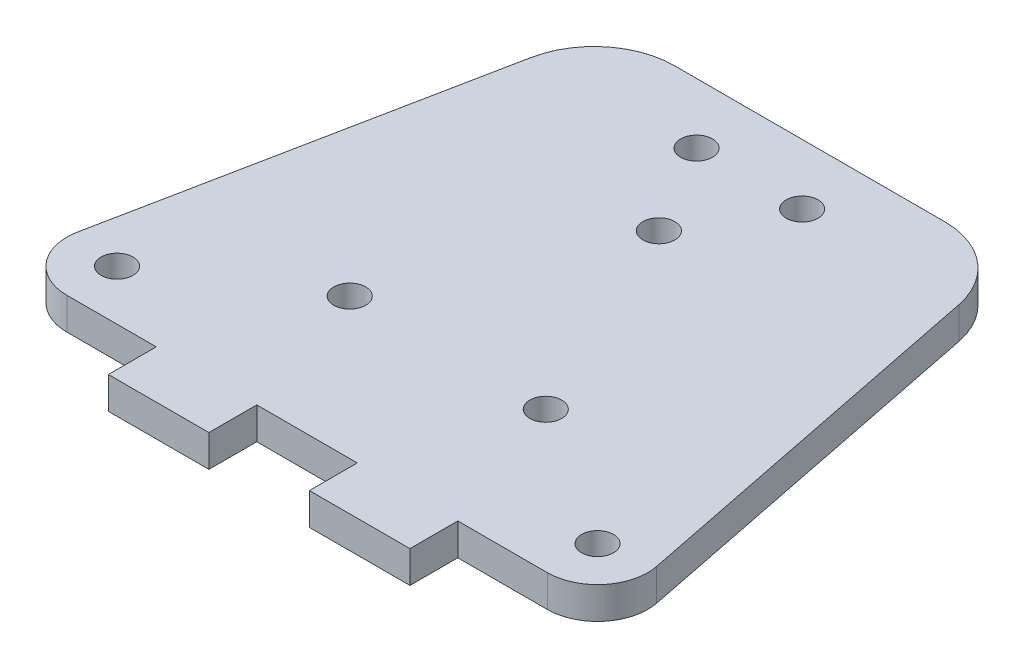
ISO-10303-21;
HEADER;
FILE_DESCRIPTION(('STEP AP214'),'2;1');
FILE_NAME('part.step','',(''),(''),'','','');
FILE_SCHEMA(('AUTOMOTIVE_DESIGN { 1 0 10303 214 1 1 1 1 }'));
ENDSEC;
DATA;
#1=APPLICATION_CONTEXT('core data for automotive mechanical design processes');
#2=APPLICATION_PROTOCOL_DEFINITION('international standard','automotive_design',2000,#1);
#3=PRODUCT_CONTEXT('',#1,'mechanical');
#4=PRODUCT('Part','Part','',(#3));
#5=PRODUCT_RELATED_PRODUCT_CATEGORY('part','',(#4));
#6=PRODUCT_DEFINITION_FORMATION('','',#4);
#7=PRODUCT_DEFINITION_CONTEXT('part definition',#1,'design');
#8=PRODUCT_DEFINITION('design','',#6,#7);
#9=PRODUCT_DEFINITION_SHAPE('','',#8);
#10=(LENGTH_UNIT() NAMED_UNIT(*) SI_UNIT(.MILLI.,.METRE.));
#11=(NAMED_UNIT(*) PLANE_ANGLE_UNIT() SI_UNIT($,.RADIAN.));
#12=(NAMED_UNIT(*) SI_UNIT($,.STERADIAN.) SOLID_ANGLE_UNIT());
#13=UNCERTAINTY_MEASURE_WITH_UNIT(LENGTH_MEASURE(1.E-05),#10,'distance_accuracy_value','');
#14=(GEOMETRIC_REPRESENTATION_CONTEXT(3) GLOBAL_UNCERTAINTY_ASSIGNED_CONTEXT((#13)) GLOBAL_UNIT_ASSIGNED_CONTEXT((#10,
#11,#12)) REPRESENTATION_CONTEXT('',''));
#15=CARTESIAN_POINT('',(0.,0.,0.));
#16=DIRECTION('',(0.,0.,1.));
#17=DIRECTION('',(1.,0.,0.));
#18=AXIS2_PLACEMENT_3D('',#15,#16,#17);
#19=CARTESIAN_POINT('',(0.,3.175,0.));
#20=DIRECTION('',(0.,0.,-1.));
#21=DIRECTION('',(-1.,0.,0.));
#22=AXIS2_PLACEMENT_3D('',#19,#20,#21);
#23=PLANE('',#22);
#24=DIRECTION('',(1.,0.,0.));
#25=VECTOR('',#24,1.);
#26=CARTESIAN_POINT('',(0.,0.,0.));
#27=LINE('',#26,#25);
#28=CARTESIAN_POINT('',(25.,0.,0.));
#29=VERTEX_POINT('',#28);
#30=CARTESIAN_POINT('',(35.,0.,0.));
#31=VERTEX_POINT('',#30);
#32=EDGE_CURVE('E306',#29,#31,#27,.T.);
#33=ORIENTED_EDGE('',*,*,#32,.T.);
#34=DIRECTION('',(0.,1.,0.));
#35=VECTOR('',#34,1.);
#36=CARTESIAN_POINT('',(35.,0.,0.));
#37=LINE('',#36,#35);
#38=CARTESIAN_POINT('',(35.,3.175,0.));
#39=VERTEX_POINT('',#38);
#40=EDGE_CURVE('E59',#31,#39,#37,.T.);
#41=ORIENTED_EDGE('',*,*,#40,.T.);
#42=DIRECTION('',(1.,0.,0.));
#43=VECTOR('',#42,1.);
#44=CARTESIAN_POINT('',(0.,3.175,0.));
#45=LINE('',#44,#43);
#46=CARTESIAN_POINT('',(25.,3.175,0.));
#47=VERTEX_POINT('',#46);
#48=EDGE_CURVE('E291',#47,#39,#45,.T.);
#49=ORIENTED_EDGE('',*,*,#48,.F.);
#50=DIRECTION('',(0.,1.,0.));
#51=VECTOR('',#50,1.);
#52=CARTESIAN_POINT('',(25.,0.,0.));
#53=LINE('',#52,#51);
#54=EDGE_CURVE('E208',#29,#47,#53,.T.);
#55=ORIENTED_EDGE('',*,*,#54,.F.);
#56=EDGE_LOOP('',(#33,#41,#49,#55));
#57=FACE_BOUND('',#56,.T.);
#58=ADVANCED_FACE('F36',(#57),#23,.F.);
#59=CARTESIAN_POINT('',(6.09901951359281,0.,0.));
#60=VERTEX_POINT('',#59);
#61=CARTESIAN_POINT('',(15.,0.,0.));
#62=VERTEX_POINT('',#61);
#63=EDGE_CURVE('E304',#60,#62,#27,.T.);
#64=ORIENTED_EDGE('',*,*,#63,.T.);
#65=DIRECTION('',(0.,1.,0.));
#66=VECTOR('',#65,1.);
#67=CARTESIAN_POINT('',(15.,0.,0.));
#68=LINE('',#67,#66);
#69=CARTESIAN_POINT('',(15.,3.175,0.));
#70=VERTEX_POINT('',#69);
#71=EDGE_CURVE('E205',#62,#70,#68,.T.);
#72=ORIENTED_EDGE('',*,*,#71,.T.);
#73=CARTESIAN_POINT('',(6.09901951359281,3.175,0.));
#74=VERTEX_POINT('',#73);
#75=EDGE_CURVE('E287',#74,#70,#45,.T.);
#76=ORIENTED_EDGE('',*,*,#75,.F.);
#77=DIRECTION('',(0.,1.,0.));
#78=VECTOR('',#77,1.);
#79=CARTESIAN_POINT('',(6.09901951359281,0.,0.));
#80=LINE('',#79,#78);
#81=EDGE_CURVE('E229',#60,#74,#80,.T.);
#82=ORIENTED_EDGE('',*,*,#81,.F.);
#83=EDGE_LOOP('',(#64,#72,#76,#82));
#84=FACE_BOUND('',#83,.T.);
#85=ADVANCED_FACE('F361',(#84),#23,.F.);
#86=CARTESIAN_POINT('',(45.,3.175,0.));
#87=VERTEX_POINT('',#86);
#88=CARTESIAN_POINT('',(53.9009804864072,3.175,0.));
#89=VERTEX_POINT('',#88);
#90=EDGE_CURVE('E51',#87,#89,#45,.T.);
#91=ORIENTED_EDGE('',*,*,#90,.F.);
#92=DIRECTION('',(0.,1.,0.));
#93=VECTOR('',#92,1.);
#94=CARTESIAN_POINT('',(45.,0.,0.));
#95=LINE('',#94,#93);
#96=CARTESIAN_POINT('',(45.,0.,0.));
#97=VERTEX_POINT('',#96);
#98=EDGE_CURVE('E184',#97,#87,#95,.T.);
#99=ORIENTED_EDGE('',*,*,#98,.F.);
#100=CARTESIAN_POINT('',(53.9009804864072,0.,0.));
#101=VERTEX_POINT('',#100);
#102=EDGE_CURVE('E303',#97,#101,#27,.T.);
#103=ORIENTED_EDGE('',*,*,#102,.T.);
#104=DIRECTION('',(0.,1.,0.));
#105=VECTOR('',#104,1.);
#106=CARTESIAN_POINT('',(53.9009804864072,0.,0.));
#107=LINE('',#106,#105);
#108=EDGE_CURVE('E217',#101,#89,#107,.T.);
#109=ORIENTED_EDGE('',*,*,#108,.T.);
#110=EDGE_LOOP('',(#91,#99,#103,#109));
#111=FACE_BOUND('',#110,.T.);
#112=ADVANCED_FACE('F377',(#111),#23,.F.);
#113=CARTESIAN_POINT('',(8.71378581622126,3.175,-43.5689290811055));
#114=DIRECTION('',(0.980580675690919,0.,0.196116135138188));
#115=DIRECTION('',(0.196116135138188,0.,-0.98058067569092));
#116=AXIS2_PLACEMENT_3D('',#113,#114,#115);
#117=PLANE('',#116);
#118=DIRECTION('',(0.,1.,0.));
#119=VECTOR('',#118,1.);
#120=CARTESIAN_POINT('',(1.19611613513821,0.,-5.98058067569094));
#121=LINE('',#120,#119);
#122=CARTESIAN_POINT('',(1.19611613513821,0.,-5.98058067569094));
#123=VERTEX_POINT('',#122);
#124=CARTESIAN_POINT('',(1.19611613513821,3.175,-5.98058067569094));
#125=VERTEX_POINT('',#124);
#126=EDGE_CURVE('E227',#123,#125,#121,.T.);
#127=ORIENTED_EDGE('',*,*,#126,.T.);
#128=DIRECTION('',(-0.196116135138188,0.,0.980580675690919));
#129=VECTOR('',#128,1.);
#130=CARTESIAN_POINT('',(8.71378581622126,3.175,-43.5689290811055));
#131=LINE('',#130,#129);
#132=CARTESIAN_POINT('',(8.71378581622126,3.175,-43.5689290811055));
#133=VERTEX_POINT('',#132);
#134=EDGE_CURVE('E284',#133,#125,#131,.T.);
#135=ORIENTED_EDGE('',*,*,#134,.F.);
#136=DIRECTION('',(0.,-1.,0.));
#137=VECTOR('',#136,1.);
#138=CARTESIAN_POINT('',(8.71378581622126,3.175,-43.5689290811055));
#139=LINE('',#138,#137);
#140=CARTESIAN_POINT('',(8.71378581622126,0.,-43.5689290811055));
#141=VERTEX_POINT('',#140);
#142=EDGE_CURVE('E310',#133,#141,#139,.T.);
#143=ORIENTED_EDGE('',*,*,#142,.T.);
#144=DIRECTION('',(-0.196116135138188,0.,0.980580675690919));
#145=VECTOR('',#144,1.);
#146=CARTESIAN_POINT('',(8.71378581622126,0.,-43.5689290811055));
#147=LINE('',#146,#145);
#148=EDGE_CURVE('E300',#141,#123,#147,.T.);
#149=ORIENTED_EDGE('',*,*,#148,.T.);
#150=EDGE_LOOP('',(#127,#135,#143,#149));
#151=FACE_BOUND('',#150,.T.);
#152=ADVANCED_FACE('F324',(#151),#117,.F.);
#153=CARTESIAN_POINT('',(43.4415687782517,3.175,-42.));
#154=DIRECTION('',(0.,1.,0.));
#155=DIRECTION('',(0.,0.,1.));
#156=AXIS2_PLACEMENT_3D('',#153,#154,#155);
#157=PLANE('',#156);
#158=CARTESIAN_POINT('',(53.9009804864072,3.175,-5.));
#159=DIRECTION('',(0.,-1.,0.));
#160=DIRECTION('',(0.,0.,1.));
#161=AXIS2_PLACEMENT_3D('',#158,#159,#160);
#162=CIRCLE('',#161,5.);
#163=CARTESIAN_POINT('',(58.8038838648618,3.175,-5.9805806756909));
#164=VERTEX_POINT('',#163);
#165=EDGE_CURVE('E207',#164,#89,#162,.T.);
#166=ORIENTED_EDGE('',*,*,#165,.F.);
#167=DIRECTION('',(-0.19611613513818,0.,-0.980580675690921));
#168=VECTOR('',#167,1.);
#169=CARTESIAN_POINT('',(51.2862141837791,3.175,-43.5689290811054));
#170=LINE('',#169,#168);
#171=CARTESIAN_POINT('',(51.2862141837791,3.175,-43.5689290811054));
#172=VERTEX_POINT('',#171);
#173=EDGE_CURVE('E290',#164,#172,#170,.T.);
#174=ORIENTED_EDGE('',*,*,#173,.T.);
#175=CARTESIAN_POINT('',(43.4415687782517,3.175,-42.));
#176=DIRECTION('',(0.,1.,0.));
#177=DIRECTION('',(0.,0.,1.));
#178=AXIS2_PLACEMENT_3D('',#175,#176,#177);
#179=CIRCLE('',#178,8.);
#180=CARTESIAN_POINT('',(43.4415687782517,3.175,-50.));
#181=VERTEX_POINT('',#180);
#182=EDGE_CURVE('E276',#172,#181,#179,.T.);
#183=ORIENTED_EDGE('',*,*,#182,.T.);
#184=DIRECTION('',(-1.,0.,0.));
#185=VECTOR('',#184,1.);
#186=CARTESIAN_POINT('',(16.5584312217487,3.175,-50.));
#187=LINE('',#186,#185);
#188=CARTESIAN_POINT('',(16.5584312217487,3.175,-50.));
#189=VERTEX_POINT('',#188);
#190=EDGE_CURVE('E279',#181,#189,#187,.T.);
#191=ORIENTED_EDGE('',*,*,#190,.T.);
#192=CARTESIAN_POINT('',(16.5584312217486,3.175,-42.));
#193=DIRECTION('',(0.,1.,0.));
#194=DIRECTION('',(0.,0.,-1.));
#195=AXIS2_PLACEMENT_3D('',#192,#193,#194);
#196=CIRCLE('',#195,8.);
#197=EDGE_CURVE('E282',#189,#133,#196,.T.);
#198=ORIENTED_EDGE('',*,*,#197,.T.);
#199=ORIENTED_EDGE('',*,*,#134,.T.);
#200=CARTESIAN_POINT('',(6.09901951359281,3.175,-5.));
#201=DIRECTION('',(0.,-1.,0.));
#202=DIRECTION('',(0.,0.,1.));
#203=AXIS2_PLACEMENT_3D('',#200,#201,#202);
#204=CIRCLE('',#203,5.);
#205=EDGE_CURVE('E222',#74,#125,#204,.T.);
#206=ORIENTED_EDGE('',*,*,#205,.F.);
#207=ORIENTED_EDGE('',*,*,#75,.T.);
#208=DIRECTION('',(0.,0.,1.));
#209=VECTOR('',#208,1.);
#210=CARTESIAN_POINT('',(15.,3.175,0.));
#211=LINE('',#210,#209);
#212=CARTESIAN_POINT('',(15.,3.175,4.7625));
#213=VERTEX_POINT('',#212);
#214=EDGE_CURVE('E183',#70,#213,#211,.T.);
#215=ORIENTED_EDGE('',*,*,#214,.T.);
#216=DIRECTION('',(1.,0.,0.));
#217=VECTOR('',#216,1.);
#218=CARTESIAN_POINT('',(15.,3.175,4.7625));
#219=LINE('',#218,#217);
#220=CARTESIAN_POINT('',(25.,3.175,4.7625));
#221=VERTEX_POINT('',#220);
#222=EDGE_CURVE('E200',#213,#221,#219,.T.);
#223=ORIENTED_EDGE('',*,*,#222,.T.);
#224=DIRECTION('',(0.,0.,-1.));
#225=VECTOR('',#224,1.);
#226=CARTESIAN_POINT('',(25.,3.175,0.));
#227=LINE('',#226,#225);
#228=EDGE_CURVE('E191',#221,#47,#227,.T.);
#229=ORIENTED_EDGE('',*,*,#228,.T.);
#230=ORIENTED_EDGE('',*,*,#48,.T.);
#231=DIRECTION('',(0.,0.,1.));
#232=VECTOR('',#231,1.);
#233=CARTESIAN_POINT('',(35.,3.175,0.));
#234=LINE('',#233,#232);
#235=CARTESIAN_POINT('',(35.,3.175,4.7625));
#236=VERTEX_POINT('',#235);
#237=EDGE_CURVE('E179',#39,#236,#234,.T.);
#238=ORIENTED_EDGE('',*,*,#237,.T.);
#239=DIRECTION('',(1.,0.,0.));
#240=VECTOR('',#239,1.);
#241=CARTESIAN_POINT('',(35.,3.175,4.7625));
#242=LINE('',#241,#240);
#243=CARTESIAN_POINT('',(45.,3.175,4.7625));
#244=VERTEX_POINT('',#243);
#245=EDGE_CURVE('E155',#236,#244,#242,.T.);
#246=ORIENTED_EDGE('',*,*,#245,.T.);
#247=DIRECTION('',(0.,0.,-1.));
#248=VECTOR('',#247,1.);
#249=CARTESIAN_POINT('',(45.,3.175,0.));
#250=LINE('',#249,#248);
#251=EDGE_CURVE('E173',#244,#87,#250,.T.);
#252=ORIENTED_EDGE('',*,*,#251,.T.);
#253=ORIENTED_EDGE('',*,*,#90,.T.);
#254=EDGE_LOOP('',(#166,#174,#183,#191,#198,#199,#206,#207,#215,#223,#229,#230,#238,#246,#252,#253));
#255=FACE_BOUND('',#254,.T.);
#256=CARTESIAN_POINT('',(53.9009804864072,3.175,-5.));
#257=DIRECTION('',(0.,1.,0.));
#258=DIRECTION('',(0.,0.,1.));
#259=AXIS2_PLACEMENT_3D('',#256,#257,#258);
#260=CIRCLE('',#259,1.5875);
#261=CARTESIAN_POINT('',(53.9009804864072,3.175,-3.4125));
#262=VERTEX_POINT('',#261);
#263=EDGE_CURVE('E231',#262,#262,#260,.T.);
#264=ORIENTED_EDGE('',*,*,#263,.F.);
#265=EDGE_LOOP('',(#264));
#266=FACE_BOUND('',#265,.T.);
#267=CARTESIAN_POINT('',(6.09901951359281,3.175,-5.));
#268=DIRECTION('',(0.,1.,0.));
#269=DIRECTION('',(0.,0.,1.));
#270=AXIS2_PLACEMENT_3D('',#267,#268,#269);
#271=CIRCLE('',#270,1.5875);
#272=CARTESIAN_POINT('',(6.09901951359281,3.175,-3.4125));
#273=VERTEX_POINT('',#272);
#274=EDGE_CURVE('E237',#273,#273,#271,.T.);
#275=ORIENTED_EDGE('',*,*,#274,.F.);
#276=EDGE_LOOP('',(#275));
#277=FACE_BOUND('',#276,.T.);
#278=CARTESIAN_POINT('',(30.,3.175,-35.));
#279=DIRECTION('',(0.,1.,0.));
#280=DIRECTION('',(0.,0.,1.));
#281=AXIS2_PLACEMENT_3D('',#278,#279,#280);
#282=CIRCLE('',#281,1.5875);
#283=CARTESIAN_POINT('',(30.,3.175,-33.4125));
#284=VERTEX_POINT('',#283);
#285=EDGE_CURVE('E243',#284,#284,#282,.T.);
#286=ORIENTED_EDGE('',*,*,#285,.F.);
#287=EDGE_LOOP('',(#286));
#288=FACE_BOUND('',#287,.T.);
#289=CARTESIAN_POINT('',(24.75,3.175,-44.));
#290=DIRECTION('',(0.,1.,0.));
#291=DIRECTION('',(0.,0.,1.));
#292=AXIS2_PLACEMENT_3D('',#289,#290,#291);
#293=CIRCLE('',#292,1.5875);
#294=CARTESIAN_POINT('',(24.75,3.175,-42.4125));
#295=VERTEX_POINT('',#294);
#296=EDGE_CURVE('E258',#295,#295,#293,.T.);
#297=ORIENTED_EDGE('',*,*,#296,.F.);
#298=EDGE_LOOP('',(#297));
#299=FACE_BOUND('',#298,.T.);
#300=CARTESIAN_POINT('',(39.75,3.175,-14.));
#301=DIRECTION('',(0.,1.,0.));
#302=DIRECTION('',(0.,0.,1.));
#303=AXIS2_PLACEMENT_3D('',#300,#301,#302);
#304=CIRCLE('',#303,1.5875);
#305=CARTESIAN_POINT('',(39.75,3.175,-12.4125));
#306=VERTEX_POINT('',#305);
#307=EDGE_CURVE('E270',#306,#306,#304,.T.);
#308=ORIENTED_EDGE('',*,*,#307,.F.);
#309=EDGE_LOOP('',(#308));
#310=FACE_BOUND('',#309,.T.);
#311=CARTESIAN_POINT('',(20.25,3.175,-14.));
#312=DIRECTION('',(0.,1.,0.));
#313=DIRECTION('',(0.,0.,1.));
#314=AXIS2_PLACEMENT_3D('',#311,#312,#313);
#315=CIRCLE('',#314,1.5875);
#316=CARTESIAN_POINT('',(20.25,3.175,-12.4125));
#317=VERTEX_POINT('',#316);
#318=EDGE_CURVE('E264',#317,#317,#315,.T.);
#319=ORIENTED_EDGE('',*,*,#318,.F.);
#320=EDGE_LOOP('',(#319));
#321=FACE_BOUND('',#320,.T.);
#322=CARTESIAN_POINT('',(35.25,3.175,-44.));
#323=DIRECTION('',(0.,1.,0.));
#324=DIRECTION('',(0.,0.,1.));
#325=AXIS2_PLACEMENT_3D('',#322,#323,#324);
#326=CIRCLE('',#325,1.5875);
#327=CARTESIAN_POINT('',(35.25,3.175,-42.4125));
#328=VERTEX_POINT('',#327);
#329=EDGE_CURVE('E252',#328,#328,#326,.T.);
#330=ORIENTED_EDGE('',*,*,#329,.F.);
#331=EDGE_LOOP('',(#330));
#332=FACE_BOUND('',#331,.T.);
#333=ADVANCED_FACE('F329',(#255,#266,#277,#288,#299,#310,#321,#332),#157,.T.);
#334=CARTESIAN_POINT('',(43.4415687782517,0.,-42.));
#335=DIRECTION('',(0.,1.,0.));
#336=DIRECTION('',(0.,0.,1.));
#337=AXIS2_PLACEMENT_3D('',#334,#335,#336);
#338=PLANE('',#337);
#339=CARTESIAN_POINT('',(53.9009804864072,0.,-5.));
#340=DIRECTION('',(0.,1.,0.));
#341=DIRECTION('',(0.,0.,1.));
#342=AXIS2_PLACEMENT_3D('',#339,#340,#341);
#343=CIRCLE('',#342,1.5875);
#344=CARTESIAN_POINT('',(53.9009804864072,0.,-3.4125));
#345=VERTEX_POINT('',#344);
#346=EDGE_CURVE('E234',#345,#345,#343,.T.);
#347=ORIENTED_EDGE('',*,*,#346,.T.);
#348=EDGE_LOOP('',(#347));
#349=FACE_BOUND('',#348,.T.);
#350=CARTESIAN_POINT('',(6.09901951359281,0.,-5.));
#351=DIRECTION('',(0.,1.,0.));
#352=DIRECTION('',(0.,0.,1.));
#353=AXIS2_PLACEMENT_3D('',#350,#351,#352);
#354=CIRCLE('',#353,1.5875);
#355=CARTESIAN_POINT('',(6.09901951359281,0.,-3.4125));
#356=VERTEX_POINT('',#355);
#357=EDGE_CURVE('E240',#356,#356,#354,.T.);
#358=ORIENTED_EDGE('',*,*,#357,.T.);
#359=EDGE_LOOP('',(#358));
#360=FACE_BOUND('',#359,.T.);
#361=CARTESIAN_POINT('',(30.,0.,-35.));
#362=DIRECTION('',(0.,1.,0.));
#363=DIRECTION('',(0.,0.,1.));
#364=AXIS2_PLACEMENT_3D('',#361,#362,#363);
#365=CIRCLE('',#364,1.5875);
#366=CARTESIAN_POINT('',(30.,0.,-33.4125));
#367=VERTEX_POINT('',#366);
#368=EDGE_CURVE('E246',#367,#367,#365,.T.);
#369=ORIENTED_EDGE('',*,*,#368,.T.);
#370=EDGE_LOOP('',(#369));
#371=FACE_BOUND('',#370,.T.);
#372=CARTESIAN_POINT('',(24.75,0.,-44.));
#373=DIRECTION('',(0.,1.,0.));
#374=DIRECTION('',(0.,0.,1.));
#375=AXIS2_PLACEMENT_3D('',#372,#373,#374);
#376=CIRCLE('',#375,1.5875);
#377=CARTESIAN_POINT('',(24.75,0.,-42.4125));
#378=VERTEX_POINT('',#377);
#379=EDGE_CURVE('E255',#378,#378,#376,.T.);
#380=ORIENTED_EDGE('',*,*,#379,.T.);
#381=EDGE_LOOP('',(#380));
#382=FACE_BOUND('',#381,.T.);
#383=CARTESIAN_POINT('',(39.75,0.,-14.));
#384=DIRECTION('',(0.,1.,0.));
#385=DIRECTION('',(0.,0.,1.));
#386=AXIS2_PLACEMENT_3D('',#383,#384,#385);
#387=CIRCLE('',#386,1.5875);
#388=CARTESIAN_POINT('',(39.75,0.,-12.4125));
#389=VERTEX_POINT('',#388);
#390=EDGE_CURVE('E267',#389,#389,#387,.T.);
#391=ORIENTED_EDGE('',*,*,#390,.T.);
#392=EDGE_LOOP('',(#391));
#393=FACE_BOUND('',#392,.T.);
#394=DIRECTION('',(-0.19611613513818,0.,-0.980580675690921));
#395=VECTOR('',#394,1.);
#396=CARTESIAN_POINT('',(51.2862141837791,0.,-43.5689290811054));
#397=LINE('',#396,#395);
#398=CARTESIAN_POINT('',(58.8038838648618,0.,-5.98058067569091));
#399=VERTEX_POINT('',#398);
#400=CARTESIAN_POINT('',(51.2862141837791,0.,-43.5689290811054));
#401=VERTEX_POINT('',#400);
#402=EDGE_CURVE('E280',#399,#401,#397,.T.);
#403=ORIENTED_EDGE('',*,*,#402,.F.);
#404=CARTESIAN_POINT('',(53.9009804864072,0.,-5.));
#405=DIRECTION('',(0.,-1.,0.));
#406=DIRECTION('',(0.,0.,1.));
#407=AXIS2_PLACEMENT_3D('',#404,#405,#406);
#408=CIRCLE('',#407,5.);
#409=EDGE_CURVE('E214',#399,#101,#408,.T.);
#410=ORIENTED_EDGE('',*,*,#409,.T.);
#411=ORIENTED_EDGE('',*,*,#102,.F.);
#412=DIRECTION('',(0.,0.,-1.));
#413=VECTOR('',#412,1.);
#414=CARTESIAN_POINT('',(45.,0.,0.));
#415=LINE('',#414,#413);
#416=CARTESIAN_POINT('',(45.,0.,4.7625));
#417=VERTEX_POINT('',#416);
#418=EDGE_CURVE('E161',#417,#97,#415,.T.);
#419=ORIENTED_EDGE('',*,*,#418,.F.);
#420=DIRECTION('',(1.,0.,0.));
#421=VECTOR('',#420,1.);
#422=CARTESIAN_POINT('',(35.,0.,4.7625));
#423=LINE('',#422,#421);
#424=CARTESIAN_POINT('',(35.,0.,4.7625));
#425=VERTEX_POINT('',#424);
#426=EDGE_CURVE('E153',#425,#417,#423,.T.);
#427=ORIENTED_EDGE('',*,*,#426,.F.);
#428=DIRECTION('',(0.,0.,1.));
#429=VECTOR('',#428,1.);
#430=CARTESIAN_POINT('',(35.,0.,0.));
#431=LINE('',#430,#429);
#432=EDGE_CURVE('E169',#31,#425,#431,.T.);
#433=ORIENTED_EDGE('',*,*,#432,.F.);
#434=ORIENTED_EDGE('',*,*,#32,.F.);
#435=DIRECTION('',(0.,0.,-1.));
#436=VECTOR('',#435,1.);
#437=CARTESIAN_POINT('',(25.,0.,0.));
#438=LINE('',#437,#436);
#439=CARTESIAN_POINT('',(25.,0.,4.7625));
#440=VERTEX_POINT('',#439);
#441=EDGE_CURVE('E194',#440,#29,#438,.T.);
#442=ORIENTED_EDGE('',*,*,#441,.F.);
#443=DIRECTION('',(1.,0.,0.));
#444=VECTOR('',#443,1.);
#445=CARTESIAN_POINT('',(15.,0.,4.7625));
#446=LINE('',#445,#444);
#447=CARTESIAN_POINT('',(15.,0.,4.7625));
#448=VERTEX_POINT('',#447);
#449=EDGE_CURVE('E190',#448,#440,#446,.T.);
#450=ORIENTED_EDGE('',*,*,#449,.F.);
#451=DIRECTION('',(0.,0.,1.));
#452=VECTOR('',#451,1.);
#453=CARTESIAN_POINT('',(15.,0.,0.));
#454=LINE('',#453,#452);
#455=EDGE_CURVE('E187',#62,#448,#454,.T.);
#456=ORIENTED_EDGE('',*,*,#455,.F.);
#457=ORIENTED_EDGE('',*,*,#63,.F.);
#458=CARTESIAN_POINT('',(6.09901951359281,0.,-5.));
#459=DIRECTION('',(0.,-1.,0.));
#460=DIRECTION('',(0.,0.,1.));
#461=AXIS2_PLACEMENT_3D('',#458,#459,#460);
#462=CIRCLE('',#461,5.);
#463=EDGE_CURVE('E224',#60,#123,#462,.T.);
#464=ORIENTED_EDGE('',*,*,#463,.T.);
#465=ORIENTED_EDGE('',*,*,#148,.F.);
#466=CARTESIAN_POINT('',(16.5584312217486,0.,-42.));
#467=DIRECTION('',(0.,1.,0.));
#468=DIRECTION('',(0.,0.,-1.));
#469=AXIS2_PLACEMENT_3D('',#466,#467,#468);
#470=CIRCLE('',#469,8.);
#471=CARTESIAN_POINT('',(16.5584312217487,0.,-50.));
#472=VERTEX_POINT('',#471);
#473=EDGE_CURVE('E298',#472,#141,#470,.T.);
#474=ORIENTED_EDGE('',*,*,#473,.F.);
#475=DIRECTION('',(-1.,0.,0.));
#476=VECTOR('',#475,1.);
#477=CARTESIAN_POINT('',(16.5584312217487,0.,-50.));
#478=LINE('',#477,#476);
#479=CARTESIAN_POINT('',(43.4415687782517,0.,-50.));
#480=VERTEX_POINT('',#479);
#481=EDGE_CURVE('E296',#480,#472,#478,.T.);
#482=ORIENTED_EDGE('',*,*,#481,.F.);
#483=CARTESIAN_POINT('',(43.4415687782517,0.,-42.));
#484=DIRECTION('',(0.,1.,0.));
#485=DIRECTION('',(0.,0.,1.));
#486=AXIS2_PLACEMENT_3D('',#483,#484,#485);
#487=CIRCLE('',#486,8.);
#488=EDGE_CURVE('E273',#401,#480,#487,.T.);
#489=ORIENTED_EDGE('',*,*,#488,.F.);
#490=EDGE_LOOP('',(#403,#410,#411,#419,#427,#433,#434,#442,#450,#456,#457,#464,#465,#474,#482,#489));
#491=FACE_BOUND('',#490,.T.);
#492=CARTESIAN_POINT('',(20.25,0.,-14.));
#493=DIRECTION('',(0.,1.,0.));
#494=DIRECTION('',(0.,0.,1.));
#495=AXIS2_PLACEMENT_3D('',#492,#493,#494);
#496=CIRCLE('',#495,1.5875);
#497=CARTESIAN_POINT('',(20.25,0.,-12.4125));
#498=VERTEX_POINT('',#497);
#499=EDGE_CURVE('E261',#498,#498,#496,.T.);
#500=ORIENTED_EDGE('',*,*,#499,.T.);
#501=EDGE_LOOP('',(#500));
#502=FACE_BOUND('',#501,.T.);
#503=CARTESIAN_POINT('',(35.25,0.,-44.));
#504=DIRECTION('',(0.,1.,0.));
#505=DIRECTION('',(0.,0.,1.));
#506=AXIS2_PLACEMENT_3D('',#503,#504,#505);
#507=CIRCLE('',#506,1.5875);
#508=CARTESIAN_POINT('',(35.25,0.,-42.4125));
#509=VERTEX_POINT('',#508);
#510=EDGE_CURVE('E249',#509,#509,#507,.T.);
#511=ORIENTED_EDGE('',*,*,#510,.T.);
#512=EDGE_LOOP('',(#511));
#513=FACE_BOUND('',#512,.T.);
#514=ADVANCED_FACE('F167',(#349,#360,#371,#382,#393,#491,#502,#513),#338,.F.);
#515=CARTESIAN_POINT('',(43.4415687782517,3.175,-42.));
#516=DIRECTION('',(0.,-1.,0.));
#517=DIRECTION('',(0.,0.,-1.));
#518=AXIS2_PLACEMENT_3D('',#515,#516,#517);
#519=CYLINDRICAL_SURFACE('',#518,8.);
#520=ORIENTED_EDGE('',*,*,#488,.T.);
#521=DIRECTION('',(0.,-1.,0.));
#522=VECTOR('',#521,1.);
#523=CARTESIAN_POINT('',(43.4415687782517,3.175,-50.));
#524=LINE('',#523,#522);
#525=EDGE_CURVE('E11',#181,#480,#524,.T.);
#526=ORIENTED_EDGE('',*,*,#525,.F.);
#527=ORIENTED_EDGE('',*,*,#182,.F.);
#528=DIRECTION('',(0.,-1.,0.));
#529=VECTOR('',#528,1.);
#530=CARTESIAN_POINT('',(51.2862141837791,3.175,-43.5689290811054));
#531=LINE('',#530,#529);
#532=EDGE_CURVE('E293',#172,#401,#531,.T.);
#533=ORIENTED_EDGE('',*,*,#532,.T.);
#534=EDGE_LOOP('',(#520,#526,#527,#533));
#535=FACE_BOUND('',#534,.T.);
#536=ADVANCED_FACE('F38',(#535),#519,.T.);
#537=CARTESIAN_POINT('',(16.5584312217487,3.175,-50.));
#538=DIRECTION('',(0.,0.,1.));
#539=DIRECTION('',(1.,0.,0.));
#540=AXIS2_PLACEMENT_3D('',#537,#538,#539);
#541=PLANE('',#540);
#542=ORIENTED_EDGE('',*,*,#481,.T.);
#543=DIRECTION('',(0.,-1.,0.));
#544=VECTOR('',#543,1.);
#545=CARTESIAN_POINT('',(16.5584312217487,3.175,-50.));
#546=LINE('',#545,#544);
#547=EDGE_CURVE('E44',#189,#472,#546,.T.);
#548=ORIENTED_EDGE('',*,*,#547,.F.);
#549=ORIENTED_EDGE('',*,*,#190,.F.);
#550=ORIENTED_EDGE('',*,*,#525,.T.);
#551=EDGE_LOOP('',(#542,#548,#549,#550));
#552=FACE_BOUND('',#551,.T.);
#553=ADVANCED_FACE('F334',(#552),#541,.F.);
#554=CARTESIAN_POINT('',(16.5584312217486,3.175,-42.));
#555=DIRECTION('',(0.,-1.,0.));
#556=DIRECTION('',(0.,0.,-1.));
#557=AXIS2_PLACEMENT_3D('',#554,#555,#556);
#558=CYLINDRICAL_SURFACE('',#557,8.);
#559=ORIENTED_EDGE('',*,*,#473,.T.);
#560=ORIENTED_EDGE('',*,*,#142,.F.);
#561=ORIENTED_EDGE('',*,*,#197,.F.);
#562=ORIENTED_EDGE('',*,*,#547,.T.);
#563=EDGE_LOOP('',(#559,#560,#561,#562));
#564=FACE_BOUND('',#563,.T.);
#565=ADVANCED_FACE('F317',(#564),#558,.T.);
#566=CARTESIAN_POINT('',(51.2862141837791,3.175,-43.5689290811054));
#567=DIRECTION('',(-0.980580675690921,0.,0.19611613513818));
#568=DIRECTION('',(0.19611613513818,0.,0.980580675690921));
#569=AXIS2_PLACEMENT_3D('',#566,#567,#568);
#570=PLANE('',#569);
#571=ORIENTED_EDGE('',*,*,#173,.F.);
#572=DIRECTION('',(0.,1.,0.));
#573=VECTOR('',#572,1.);
#574=CARTESIAN_POINT('',(58.8038838648618,0.,-5.9805806756909));
#575=LINE('',#574,#573);
#576=EDGE_CURVE('E220',#399,#164,#575,.T.);
#577=ORIENTED_EDGE('',*,*,#576,.F.);
#578=ORIENTED_EDGE('',*,*,#402,.T.);
#579=ORIENTED_EDGE('',*,*,#532,.F.);
#580=EDGE_LOOP('',(#571,#577,#578,#579));
#581=FACE_BOUND('',#580,.T.);
#582=ADVANCED_FACE('F340',(#581),#570,.F.);
#583=CARTESIAN_POINT('',(39.75,3.175,-14.));
#584=DIRECTION('',(0.,-1.,0.));
#585=DIRECTION('',(0.,0.,-1.));
#586=AXIS2_PLACEMENT_3D('',#583,#584,#585);
#587=CYLINDRICAL_SURFACE('',#586,1.5875);
#588=ORIENTED_EDGE('',*,*,#307,.T.);
#589=EDGE_LOOP('',(#588));
#590=FACE_BOUND('',#589,.T.);
#591=ORIENTED_EDGE('',*,*,#390,.F.);
#592=EDGE_LOOP('',(#591));
#593=FACE_BOUND('',#592,.T.);
#594=ADVANCED_FACE('F407',(#590,#593),#587,.F.);
#595=CARTESIAN_POINT('',(20.25,3.175,-14.));
#596=DIRECTION('',(0.,-1.,0.));
#597=DIRECTION('',(0.,0.,-1.));
#598=AXIS2_PLACEMENT_3D('',#595,#596,#597);
#599=CYLINDRICAL_SURFACE('',#598,1.5875);
#600=ORIENTED_EDGE('',*,*,#318,.T.);
#601=EDGE_LOOP('',(#600));
#602=FACE_BOUND('',#601,.T.);
#603=ORIENTED_EDGE('',*,*,#499,.F.);
#604=EDGE_LOOP('',(#603));
#605=FACE_BOUND('',#604,.T.);
#606=ADVANCED_FACE('F411',(#602,#605),#599,.F.);
#607=CARTESIAN_POINT('',(24.75,3.175,-44.));
#608=DIRECTION('',(0.,-1.,0.));
#609=DIRECTION('',(0.,0.,-1.));
#610=AXIS2_PLACEMENT_3D('',#607,#608,#609);
#611=CYLINDRICAL_SURFACE('',#610,1.5875);
#612=ORIENTED_EDGE('',*,*,#296,.T.);
#613=EDGE_LOOP('',(#612));
#614=FACE_BOUND('',#613,.T.);
#615=ORIENTED_EDGE('',*,*,#379,.F.);
#616=EDGE_LOOP('',(#615));
#617=FACE_BOUND('',#616,.T.);
#618=ADVANCED_FACE('F416',(#614,#617),#611,.F.);
#619=CARTESIAN_POINT('',(35.25,3.175,-44.));
#620=DIRECTION('',(0.,-1.,0.));
#621=DIRECTION('',(0.,0.,-1.));
#622=AXIS2_PLACEMENT_3D('',#619,#620,#621);
#623=CYLINDRICAL_SURFACE('',#622,1.5875);
#624=ORIENTED_EDGE('',*,*,#329,.T.);
#625=EDGE_LOOP('',(#624));
#626=FACE_BOUND('',#625,.T.);
#627=ORIENTED_EDGE('',*,*,#510,.F.);
#628=EDGE_LOOP('',(#627));
#629=FACE_BOUND('',#628,.T.);
#630=ADVANCED_FACE('F423',(#626,#629),#623,.F.);
#631=CARTESIAN_POINT('',(30.,0.,-35.));
#632=DIRECTION('',(0.,1.,0.));
#633=DIRECTION('',(0.,0.,1.));
#634=AXIS2_PLACEMENT_3D('',#631,#632,#633);
#635=CYLINDRICAL_SURFACE('',#634,1.5875);
#636=ORIENTED_EDGE('',*,*,#368,.F.);
#637=EDGE_LOOP('',(#636));
#638=FACE_BOUND('',#637,.T.);
#639=ORIENTED_EDGE('',*,*,#285,.T.);
#640=EDGE_LOOP('',(#639));
#641=FACE_BOUND('',#640,.T.);
#642=ADVANCED_FACE('F427',(#638,#641),#635,.F.);
#643=CARTESIAN_POINT('',(6.09901951359281,0.,-5.));
#644=DIRECTION('',(0.,1.,0.));
#645=DIRECTION('',(0.,0.,1.));
#646=AXIS2_PLACEMENT_3D('',#643,#644,#645);
#647=CYLINDRICAL_SURFACE('',#646,1.5875);
#648=ORIENTED_EDGE('',*,*,#357,.F.);
#649=EDGE_LOOP('',(#648));
#650=FACE_BOUND('',#649,.T.);
#651=ORIENTED_EDGE('',*,*,#274,.T.);
#652=EDGE_LOOP('',(#651));
#653=FACE_BOUND('',#652,.T.);
#654=ADVANCED_FACE('F372',(#650,#653),#647,.F.);
#655=CARTESIAN_POINT('',(53.9009804864072,0.,-5.));
#656=DIRECTION('',(0.,1.,0.));
#657=DIRECTION('',(0.,0.,1.));
#658=AXIS2_PLACEMENT_3D('',#655,#656,#657);
#659=CYLINDRICAL_SURFACE('',#658,1.5875);
#660=ORIENTED_EDGE('',*,*,#346,.F.);
#661=EDGE_LOOP('',(#660));
#662=FACE_BOUND('',#661,.T.);
#663=ORIENTED_EDGE('',*,*,#263,.T.);
#664=EDGE_LOOP('',(#663));
#665=FACE_BOUND('',#664,.T.);
#666=ADVANCED_FACE('F365',(#662,#665),#659,.F.);
#667=CARTESIAN_POINT('',(6.09901951359281,0.,-5.));
#668=DIRECTION('',(0.,1.,0.));
#669=DIRECTION('',(0.,0.,1.));
#670=AXIS2_PLACEMENT_3D('',#667,#668,#669);
#671=CYLINDRICAL_SURFACE('',#670,5.);
#672=ORIENTED_EDGE('',*,*,#205,.T.);
#673=ORIENTED_EDGE('',*,*,#126,.F.);
#674=ORIENTED_EDGE('',*,*,#463,.F.);
#675=ORIENTED_EDGE('',*,*,#81,.T.);
#676=EDGE_LOOP('',(#672,#673,#674,#675));
#677=FACE_BOUND('',#676,.T.);
#678=ADVANCED_FACE('F363',(#677),#671,.T.);
#679=CARTESIAN_POINT('',(53.9009804864072,0.,-5.));
#680=DIRECTION('',(0.,1.,0.));
#681=DIRECTION('',(0.,0.,1.));
#682=AXIS2_PLACEMENT_3D('',#679,#680,#681);
#683=CYLINDRICAL_SURFACE('',#682,5.);
#684=ORIENTED_EDGE('',*,*,#165,.T.);
#685=ORIENTED_EDGE('',*,*,#108,.F.);
#686=ORIENTED_EDGE('',*,*,#409,.F.);
#687=ORIENTED_EDGE('',*,*,#576,.T.);
#688=EDGE_LOOP('',(#684,#685,#686,#687));
#689=FACE_BOUND('',#688,.T.);
#690=ADVANCED_FACE('F342',(#689),#683,.T.);
#691=CARTESIAN_POINT('',(15.,0.,0.));
#692=DIRECTION('',(-1.,0.,0.));
#693=DIRECTION('',(0.,0.,1.));
#694=AXIS2_PLACEMENT_3D('',#691,#692,#693);
#695=PLANE('',#694);
#696=ORIENTED_EDGE('',*,*,#214,.F.);
#697=ORIENTED_EDGE('',*,*,#71,.F.);
#698=ORIENTED_EDGE('',*,*,#455,.T.);
#699=DIRECTION('',(0.,1.,0.));
#700=VECTOR('',#699,1.);
#701=CARTESIAN_POINT('',(15.,0.,4.7625));
#702=LINE('',#701,#700);
#703=EDGE_CURVE('E197',#448,#213,#702,.T.);
#704=ORIENTED_EDGE('',*,*,#703,.T.);
#705=EDGE_LOOP('',(#696,#697,#698,#704));
#706=FACE_BOUND('',#705,.T.);
#707=ADVANCED_FACE('F357',(#706),#695,.T.);
#708=CARTESIAN_POINT('',(25.,0.,0.));
#709=DIRECTION('',(1.,0.,0.));
#710=DIRECTION('',(0.,0.,-1.));
#711=AXIS2_PLACEMENT_3D('',#708,#709,#710);
#712=PLANE('',#711);
#713=ORIENTED_EDGE('',*,*,#228,.F.);
#714=DIRECTION('',(0.,1.,0.));
#715=VECTOR('',#714,1.);
#716=CARTESIAN_POINT('',(25.,0.,4.7625));
#717=LINE('',#716,#715);
#718=EDGE_CURVE('E211',#440,#221,#717,.T.);
#719=ORIENTED_EDGE('',*,*,#718,.F.);
#720=ORIENTED_EDGE('',*,*,#441,.T.);
#721=ORIENTED_EDGE('',*,*,#54,.T.);
#722=EDGE_LOOP('',(#713,#719,#720,#721));
#723=FACE_BOUND('',#722,.T.);
#724=ADVANCED_FACE('F348',(#723),#712,.T.);
#725=CARTESIAN_POINT('',(15.,0.,4.7625));
#726=DIRECTION('',(0.,0.,1.));
#727=DIRECTION('',(1.,0.,0.));
#728=AXIS2_PLACEMENT_3D('',#725,#726,#727);
#729=PLANE('',#728);
#730=ORIENTED_EDGE('',*,*,#222,.F.);
#731=ORIENTED_EDGE('',*,*,#703,.F.);
#732=ORIENTED_EDGE('',*,*,#449,.T.);
#733=ORIENTED_EDGE('',*,*,#718,.T.);
#734=EDGE_LOOP('',(#730,#731,#732,#733));
#735=FACE_BOUND('',#734,.T.);
#736=ADVANCED_FACE('F354',(#735),#729,.T.);
#737=CARTESIAN_POINT('',(35.,0.,0.));
#738=DIRECTION('',(-1.,0.,0.));
#739=DIRECTION('',(0.,0.,1.));
#740=AXIS2_PLACEMENT_3D('',#737,#738,#739);
#741=PLANE('',#740);
#742=ORIENTED_EDGE('',*,*,#237,.F.);
#743=ORIENTED_EDGE('',*,*,#40,.F.);
#744=ORIENTED_EDGE('',*,*,#432,.T.);
#745=DIRECTION('',(0.,1.,0.));
#746=VECTOR('',#745,1.);
#747=CARTESIAN_POINT('',(35.,0.,4.7625));
#748=LINE('',#747,#746);
#749=EDGE_CURVE('E150',#425,#236,#748,.T.);
#750=ORIENTED_EDGE('',*,*,#749,.T.);
#751=EDGE_LOOP('',(#742,#743,#744,#750));
#752=FACE_BOUND('',#751,.T.);
#753=ADVANCED_FACE('F172',(#752),#741,.T.);
#754=CARTESIAN_POINT('',(45.,0.,0.));
#755=DIRECTION('',(1.,0.,0.));
#756=DIRECTION('',(0.,0.,-1.));
#757=AXIS2_PLACEMENT_3D('',#754,#755,#756);
#758=PLANE('',#757);
#759=ORIENTED_EDGE('',*,*,#251,.F.);
#760=DIRECTION('',(0.,1.,0.));
#761=VECTOR('',#760,1.);
#762=CARTESIAN_POINT('',(45.,0.,4.7625));
#763=LINE('',#762,#761);
#764=EDGE_CURVE('E160',#417,#244,#763,.T.);
#765=ORIENTED_EDGE('',*,*,#764,.F.);
#766=ORIENTED_EDGE('',*,*,#418,.T.);
#767=ORIENTED_EDGE('',*,*,#98,.T.);
#768=EDGE_LOOP('',(#759,#765,#766,#767));
#769=FACE_BOUND('',#768,.T.);
#770=ADVANCED_FACE('F540',(#769),#758,.T.);
#771=CARTESIAN_POINT('',(35.,0.,4.7625));
#772=DIRECTION('',(0.,0.,1.));
#773=DIRECTION('',(1.,0.,0.));
#774=AXIS2_PLACEMENT_3D('',#771,#772,#773);
#775=PLANE('',#774);
#776=ORIENTED_EDGE('',*,*,#245,.F.);
#777=ORIENTED_EDGE('',*,*,#749,.F.);
#778=ORIENTED_EDGE('',*,*,#426,.T.);
#779=ORIENTED_EDGE('',*,*,#764,.T.);
#780=EDGE_LOOP('',(#776,#777,#778,#779));
#781=FACE_BOUND('',#780,.T.);
#782=ADVANCED_FACE('F152',(#781),#775,.T.);
#783=CLOSED_SHELL('',(#58,#85,#112,#152,#333,#514,#536,#553,#565,#582,#594,#606,#618,#630,#642,
#654,#666,#678,#690,#707,#724,#736,#753,#770,#782));
#784=MANIFOLD_SOLID_BREP('B2',#783);
#785=ADVANCED_BREP_SHAPE_REPRESENTATION('',(#18,#784),#14);
#786=SHAPE_DEFINITION_REPRESENTATION(#9,#785);
ENDSEC;
END-ISO-10303-21;
